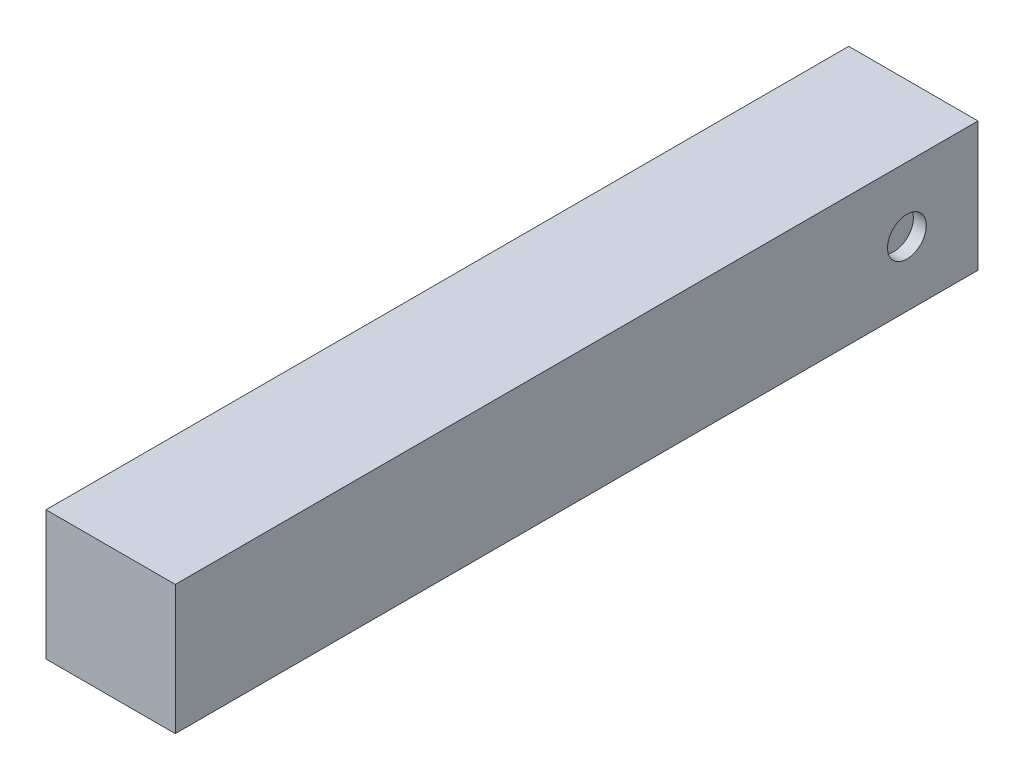
ISO-10303-21;
HEADER;
FILE_DESCRIPTION(('STEP AP214'),'2;1');
FILE_NAME('part.step','',(''),(''),'','','');
FILE_SCHEMA(('AUTOMOTIVE_DESIGN { 1 0 10303 214 1 1 1 1 }'));
ENDSEC;
DATA;
#1=APPLICATION_CONTEXT('core data for automotive mechanical design processes');
#2=APPLICATION_PROTOCOL_DEFINITION('international standard','automotive_design',2000,#1);
#3=PRODUCT_CONTEXT('',#1,'mechanical');
#4=PRODUCT('Part','Part','',(#3));
#5=PRODUCT_RELATED_PRODUCT_CATEGORY('part','',(#4));
#6=PRODUCT_DEFINITION_FORMATION('','',#4);
#7=PRODUCT_DEFINITION_CONTEXT('part definition',#1,'design');
#8=PRODUCT_DEFINITION('design','',#6,#7);
#9=PRODUCT_DEFINITION_SHAPE('','',#8);
#10=(LENGTH_UNIT() NAMED_UNIT(*) SI_UNIT(.MILLI.,.METRE.));
#11=(NAMED_UNIT(*) PLANE_ANGLE_UNIT() SI_UNIT($,.RADIAN.));
#12=(NAMED_UNIT(*) SI_UNIT($,.STERADIAN.) SOLID_ANGLE_UNIT());
#13=UNCERTAINTY_MEASURE_WITH_UNIT(LENGTH_MEASURE(1.E-05),#10,'distance_accuracy_value','');
#14=(GEOMETRIC_REPRESENTATION_CONTEXT(3) GLOBAL_UNCERTAINTY_ASSIGNED_CONTEXT((#13)) GLOBAL_UNIT_ASSIGNED_CONTEXT((#10,
#11,#12)) REPRESENTATION_CONTEXT('',''));
#15=CARTESIAN_POINT('',(0.,0.,0.));
#16=DIRECTION('',(0.,0.,1.));
#17=DIRECTION('',(1.,0.,0.));
#18=AXIS2_PLACEMENT_3D('',#15,#16,#17);
#19=CARTESIAN_POINT('',(20.,10.,-110.));
#20=DIRECTION('',(0.,0.,1.));
#21=DIRECTION('',(1.,0.,0.));
#22=AXIS2_PLACEMENT_3D('',#19,#20,#21);
#23=PLANE('',#22);
#24=CARTESIAN_POINT('',(10.,0.,-110.));
#25=DIRECTION('',(0.,0.,-1.));
#26=DIRECTION('',(-1.,0.,0.));
#27=AXIS2_PLACEMENT_3D('',#24,#25,#26);
#28=CIRCLE('',#27,6.);
#29=CARTESIAN_POINT('',(4.,0.,-110.));
#30=VERTEX_POINT('',#29);
#31=EDGE_CURVE('E111',#30,#30,#28,.T.);
#32=ORIENTED_EDGE('',*,*,#31,.F.);
#33=EDGE_LOOP('',(#32));
#34=FACE_BOUND('',#33,.T.);
#35=DIRECTION('',(0.,1.,0.));
#36=VECTOR('',#35,1.);
#37=CARTESIAN_POINT('',(0.,10.,-110.));
#38=LINE('',#37,#36);
#39=CARTESIAN_POINT('',(0.,-10.,-110.));
#40=VERTEX_POINT('',#39);
#41=CARTESIAN_POINT('',(0.,10.,-110.));
#42=VERTEX_POINT('',#41);
#43=EDGE_CURVE('E97',#40,#42,#38,.T.);
#44=ORIENTED_EDGE('',*,*,#43,.T.);
#45=DIRECTION('',(-1.,0.,0.));
#46=VECTOR('',#45,1.);
#47=CARTESIAN_POINT('',(20.,10.,-110.));
#48=LINE('',#47,#46);
#49=CARTESIAN_POINT('',(20.,10.,-110.));
#50=VERTEX_POINT('',#49);
#51=EDGE_CURVE('E11',#50,#42,#48,.T.);
#52=ORIENTED_EDGE('',*,*,#51,.F.);
#53=DIRECTION('',(0.,1.,0.));
#54=VECTOR('',#53,1.);
#55=CARTESIAN_POINT('',(20.,10.,-110.));
#56=LINE('',#55,#54);
#57=CARTESIAN_POINT('',(20.,-10.,-110.));
#58=VERTEX_POINT('',#57);
#59=EDGE_CURVE('E85',#58,#50,#56,.T.);
#60=ORIENTED_EDGE('',*,*,#59,.F.);
#61=DIRECTION('',(-1.,0.,0.));
#62=VECTOR('',#61,1.);
#63=CARTESIAN_POINT('',(20.,-10.,-110.));
#64=LINE('',#63,#62);
#65=EDGE_CURVE('E93',#58,#40,#64,.T.);
#66=ORIENTED_EDGE('',*,*,#65,.T.);
#67=EDGE_LOOP('',(#44,#52,#60,#66));
#68=FACE_BOUND('',#67,.T.);
#69=ADVANCED_FACE('F34',(#34,#68),#23,.F.);
#70=CARTESIAN_POINT('',(20.,10.,14.1759360396768));
#71=DIRECTION('',(0.,-1.,0.));
#72=DIRECTION('',(0.,0.,-1.));
#73=AXIS2_PLACEMENT_3D('',#70,#71,#72);
#74=PLANE('',#73);
#75=DIRECTION('',(0.,0.,1.));
#76=VECTOR('',#75,1.);
#77=CARTESIAN_POINT('',(0.,10.,14.1759360396768));
#78=LINE('',#77,#76);
#79=CARTESIAN_POINT('',(0.,10.,14.1759360396768));
#80=VERTEX_POINT('',#79);
#81=EDGE_CURVE('E89',#42,#80,#78,.T.);
#82=ORIENTED_EDGE('',*,*,#81,.T.);
#83=DIRECTION('',(-1.,0.,0.));
#84=VECTOR('',#83,1.);
#85=CARTESIAN_POINT('',(20.,10.,14.1759360396768));
#86=LINE('',#85,#84);
#87=CARTESIAN_POINT('',(20.,10.,14.1759360396768));
#88=VERTEX_POINT('',#87);
#89=EDGE_CURVE('E42',#88,#80,#86,.T.);
#90=ORIENTED_EDGE('',*,*,#89,.F.);
#91=DIRECTION('',(0.,0.,1.));
#92=VECTOR('',#91,1.);
#93=CARTESIAN_POINT('',(20.,10.,14.1759360396768));
#94=LINE('',#93,#92);
#95=EDGE_CURVE('E80',#50,#88,#94,.T.);
#96=ORIENTED_EDGE('',*,*,#95,.F.);
#97=ORIENTED_EDGE('',*,*,#51,.T.);
#98=EDGE_LOOP('',(#82,#90,#96,#97));
#99=FACE_BOUND('',#98,.T.);
#100=ADVANCED_FACE('F88',(#99),#74,.F.);
#101=CARTESIAN_POINT('',(20.,10.,14.1759360396768));
#102=DIRECTION('',(0.,-8.68886940608526E-07,-0.999999999999623));
#103=DIRECTION('',(0.,0.999999999999623,-8.68886940608526E-07));
#104=AXIS2_PLACEMENT_3D('',#101,#102,#103);
#105=PLANE('',#104);
#106=DIRECTION('',(0.,-0.999999999999623,8.68886940608526E-07));
#107=VECTOR('',#106,1.);
#108=CARTESIAN_POINT('',(0.,10.,14.1759360396768));
#109=LINE('',#108,#107);
#110=CARTESIAN_POINT('',(0.,-10.,14.1759534174157));
#111=VERTEX_POINT('',#110);
#112=EDGE_CURVE('E67',#80,#111,#109,.T.);
#113=ORIENTED_EDGE('',*,*,#112,.T.);
#114=DIRECTION('',(-1.,0.,0.));
#115=VECTOR('',#114,1.);
#116=CARTESIAN_POINT('',(20.,-10.,14.1759534174157));
#117=LINE('',#116,#115);
#118=CARTESIAN_POINT('',(20.,-10.,14.1759534174157));
#119=VERTEX_POINT('',#118);
#120=EDGE_CURVE('E90',#119,#111,#117,.T.);
#121=ORIENTED_EDGE('',*,*,#120,.F.);
#122=DIRECTION('',(0.,-0.999999999999623,8.68886940608526E-07));
#123=VECTOR('',#122,1.);
#124=CARTESIAN_POINT('',(20.,10.,14.1759360396768));
#125=LINE('',#124,#123);
#126=EDGE_CURVE('E83',#88,#119,#125,.T.);
#127=ORIENTED_EDGE('',*,*,#126,.F.);
#128=ORIENTED_EDGE('',*,*,#89,.T.);
#129=EDGE_LOOP('',(#113,#121,#127,#128));
#130=FACE_BOUND('',#129,.T.);
#131=ADVANCED_FACE('F91',(#130),#105,.F.);
#132=CARTESIAN_POINT('',(20.,-10.,14.1759534174157));
#133=DIRECTION('',(0.,1.,0.));
#134=DIRECTION('',(0.,0.,1.));
#135=AXIS2_PLACEMENT_3D('',#132,#133,#134);
#136=PLANE('',#135);
#137=DIRECTION('',(0.,0.,-1.));
#138=VECTOR('',#137,1.);
#139=CARTESIAN_POINT('',(0.,-10.,14.1759534174157));
#140=LINE('',#139,#138);
#141=EDGE_CURVE('E73',#111,#40,#140,.T.);
#142=ORIENTED_EDGE('',*,*,#141,.T.);
#143=ORIENTED_EDGE('',*,*,#65,.F.);
#144=DIRECTION('',(0.,0.,-1.));
#145=VECTOR('',#144,1.);
#146=CARTESIAN_POINT('',(20.,-10.,14.1759534174157));
#147=LINE('',#146,#145);
#148=EDGE_CURVE('E50',#119,#58,#147,.T.);
#149=ORIENTED_EDGE('',*,*,#148,.F.);
#150=ORIENTED_EDGE('',*,*,#120,.T.);
#151=EDGE_LOOP('',(#142,#143,#149,#150));
#152=FACE_BOUND('',#151,.T.);
#153=ADVANCED_FACE('F105',(#152),#136,.F.);
#154=CARTESIAN_POINT('',(20.,0.,0.));
#155=DIRECTION('',(1.,0.,0.));
#156=DIRECTION('',(0.,0.,-1.));
#157=AXIS2_PLACEMENT_3D('',#154,#155,#156);
#158=PLANE('',#157);
#159=CARTESIAN_POINT('',(20.,0.,-99.));
#160=DIRECTION('',(1.,0.,0.));
#161=DIRECTION('',(0.,0.,-1.));
#162=AXIS2_PLACEMENT_3D('',#159,#160,#161);
#163=CIRCLE('',#162,3.00000000000001);
#164=CARTESIAN_POINT('',(20.,0.,-102.));
#165=VERTEX_POINT('',#164);
#166=EDGE_CURVE('E117',#165,#165,#163,.T.);
#167=ORIENTED_EDGE('',*,*,#166,.F.);
#168=EDGE_LOOP('',(#167));
#169=FACE_BOUND('',#168,.T.);
#170=ORIENTED_EDGE('',*,*,#59,.T.);
#171=ORIENTED_EDGE('',*,*,#95,.T.);
#172=ORIENTED_EDGE('',*,*,#126,.T.);
#173=ORIENTED_EDGE('',*,*,#148,.T.);
#174=EDGE_LOOP('',(#170,#171,#172,#173));
#175=FACE_BOUND('',#174,.T.);
#176=ADVANCED_FACE('F81',(#169,#175),#158,.T.);
#177=CARTESIAN_POINT('',(0.,0.,0.));
#178=DIRECTION('',(1.,0.,0.));
#179=DIRECTION('',(0.,0.,-1.));
#180=AXIS2_PLACEMENT_3D('',#177,#178,#179);
#181=PLANE('',#180);
#182=ORIENTED_EDGE('',*,*,#43,.F.);
#183=ORIENTED_EDGE('',*,*,#141,.F.);
#184=ORIENTED_EDGE('',*,*,#112,.F.);
#185=ORIENTED_EDGE('',*,*,#81,.F.);
#186=EDGE_LOOP('',(#182,#183,#184,#185));
#187=FACE_BOUND('',#186,.T.);
#188=ADVANCED_FACE('F108',(#187),#181,.F.);
#189=CARTESIAN_POINT('',(10.,0.,-30.));
#190=DIRECTION('',(0.,0.,-1.));
#191=DIRECTION('',(-1.,0.,0.));
#192=AXIS2_PLACEMENT_3D('',#189,#190,#191);
#193=CYLINDRICAL_SURFACE('',#192,6.);
#194=CARTESIAN_POINT('',(10.,0.,-30.));
#195=DIRECTION('',(0.,0.,-1.));
#196=DIRECTION('',(-1.,0.,0.));
#197=AXIS2_PLACEMENT_3D('',#194,#195,#196);
#198=CIRCLE('',#197,6.);
#199=CARTESIAN_POINT('',(4.,0.,-30.));
#200=VERTEX_POINT('',#199);
#201=EDGE_CURVE('E100',#200,#200,#198,.T.);
#202=ORIENTED_EDGE('',*,*,#201,.F.);
#203=EDGE_LOOP('',(#202));
#204=FACE_BOUND('',#203,.T.);
#205=ORIENTED_EDGE('',*,*,#31,.T.);
#206=EDGE_LOOP('',(#205));
#207=FACE_BOUND('',#206,.T.);
#208=ADVANCED_FACE('F138',(#204,#207),#193,.F.);
#209=CARTESIAN_POINT('',(10.,0.,-30.));
#210=DIRECTION('',(0.,0.,-1.));
#211=DIRECTION('',(-1.,0.,0.));
#212=AXIS2_PLACEMENT_3D('',#209,#210,#211);
#213=PLANE('',#212);
#214=ORIENTED_EDGE('',*,*,#201,.T.);
#215=EDGE_LOOP('',(#214));
#216=FACE_BOUND('',#215,.T.);
#217=ADVANCED_FACE('F128',(#216),#213,.T.);
#218=CARTESIAN_POINT('',(18.,0.,-99.));
#219=DIRECTION('',(1.,0.,0.));
#220=DIRECTION('',(0.,0.,-1.));
#221=AXIS2_PLACEMENT_3D('',#218,#219,#220);
#222=CYLINDRICAL_SURFACE('',#221,3.00000000000001);
#223=CARTESIAN_POINT('',(18.,0.,-99.));
#224=DIRECTION('',(1.,0.,0.));
#225=DIRECTION('',(0.,0.,-1.));
#226=AXIS2_PLACEMENT_3D('',#223,#224,#225);
#227=CIRCLE('',#226,3.00000000000001);
#228=CARTESIAN_POINT('',(18.,0.,-102.));
#229=VERTEX_POINT('',#228);
#230=EDGE_CURVE('E114',#229,#229,#227,.T.);
#231=ORIENTED_EDGE('',*,*,#230,.F.);
#232=EDGE_LOOP('',(#231));
#233=FACE_BOUND('',#232,.T.);
#234=ORIENTED_EDGE('',*,*,#166,.T.);
#235=EDGE_LOOP('',(#234));
#236=FACE_BOUND('',#235,.T.);
#237=ADVANCED_FACE('F125',(#233,#236),#222,.F.);
#238=CARTESIAN_POINT('',(18.,0.,-99.));
#239=DIRECTION('',(1.,0.,0.));
#240=DIRECTION('',(0.,0.,-1.));
#241=AXIS2_PLACEMENT_3D('',#238,#239,#240);
#242=PLANE('',#241);
#243=ORIENTED_EDGE('',*,*,#230,.T.);
#244=EDGE_LOOP('',(#243));
#245=FACE_BOUND('',#244,.T.);
#246=ADVANCED_FACE('F123',(#245),#242,.T.);
#247=CLOSED_SHELL('',(#69,#100,#131,#153,#176,#188,#208,#217,#237,#246));
#248=MANIFOLD_SOLID_BREP('B2',#247);
#249=ADVANCED_BREP_SHAPE_REPRESENTATION('',(#18,#248),#14);
#250=SHAPE_DEFINITION_REPRESENTATION(#9,#249);
ENDSEC;
END-ISO-10303-21;
